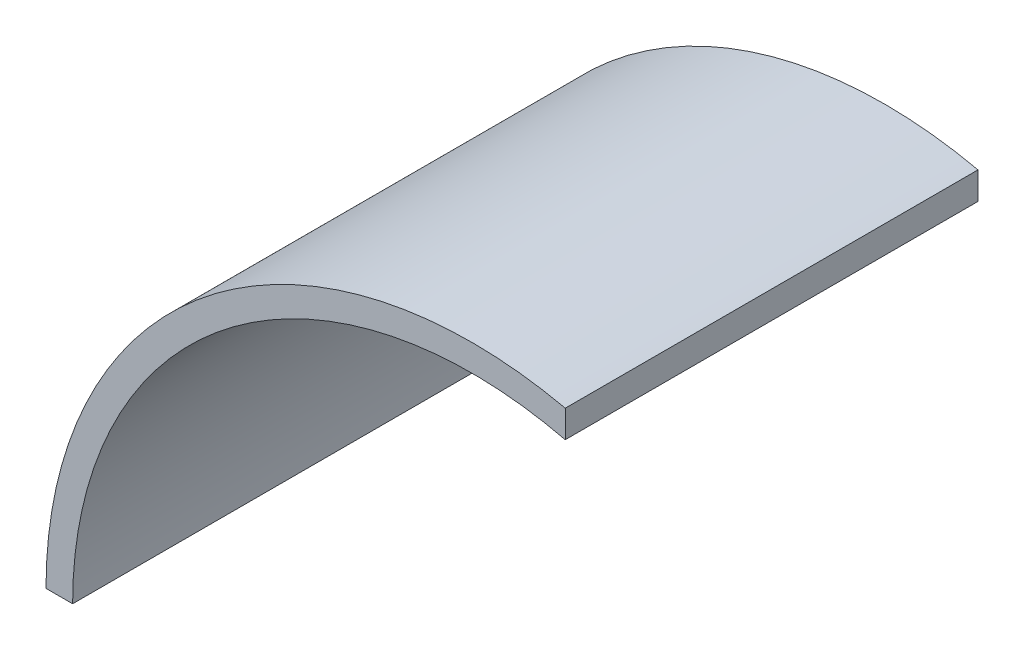
ISO-10303-21;
HEADER;
FILE_DESCRIPTION(('STEP AP214'),'2;1');
FILE_NAME('part.step','',(''),(''),'','','');
FILE_SCHEMA(('AUTOMOTIVE_DESIGN { 1 0 10303 214 1 1 1 1 }'));
ENDSEC;
DATA;
#1=APPLICATION_CONTEXT('core data for automotive mechanical design processes');
#2=APPLICATION_PROTOCOL_DEFINITION('international standard','automotive_design',2000,#1);
#3=PRODUCT_CONTEXT('',#1,'mechanical');
#4=PRODUCT('Part','Part','',(#3));
#5=PRODUCT_RELATED_PRODUCT_CATEGORY('part','',(#4));
#6=PRODUCT_DEFINITION_FORMATION('','',#4);
#7=PRODUCT_DEFINITION_CONTEXT('part definition',#1,'design');
#8=PRODUCT_DEFINITION('design','',#6,#7);
#9=PRODUCT_DEFINITION_SHAPE('','',#8);
#10=(LENGTH_UNIT() NAMED_UNIT(*) SI_UNIT(.MILLI.,.METRE.));
#11=(NAMED_UNIT(*) PLANE_ANGLE_UNIT() SI_UNIT($,.RADIAN.));
#12=(NAMED_UNIT(*) SI_UNIT($,.STERADIAN.) SOLID_ANGLE_UNIT());
#13=UNCERTAINTY_MEASURE_WITH_UNIT(LENGTH_MEASURE(1.E-05),#10,'distance_accuracy_value','');
#14=(GEOMETRIC_REPRESENTATION_CONTEXT(3) GLOBAL_UNCERTAINTY_ASSIGNED_CONTEXT((#13)) GLOBAL_UNIT_ASSIGNED_CONTEXT((#10,
#11,#12)) REPRESENTATION_CONTEXT('',''));
#15=CARTESIAN_POINT('',(0.,0.,0.));
#16=DIRECTION('',(0.,0.,1.));
#17=DIRECTION('',(1.,0.,0.));
#18=AXIS2_PLACEMENT_3D('',#15,#16,#17);
#19=CARTESIAN_POINT('',(0.,0.,155.));
#20=DIRECTION('',(0.,0.,-1.));
#21=DIRECTION('',(-1.,0.,0.));
#22=AXIS2_PLACEMENT_3D('',#19,#20,#21);
#23=CYLINDRICAL_SURFACE('',#22,160.);
#24=CARTESIAN_POINT('',(0.,0.,0.));
#25=DIRECTION('',(0.,0.,1.));
#26=DIRECTION('',(-1.,0.,0.));
#27=AXIS2_PLACEMENT_3D('',#24,#25,#26);
#28=CIRCLE('',#27,160.);
#29=CARTESIAN_POINT('',(35.,156.12494995996,0.));
#30=VERTEX_POINT('',#29);
#31=CARTESIAN_POINT('',(-160.,0.,0.));
#32=VERTEX_POINT('',#31);
#33=EDGE_CURVE('E97',#30,#32,#28,.T.);
#34=ORIENTED_EDGE('',*,*,#33,.T.);
#35=DIRECTION('',(0.,0.,-1.));
#36=VECTOR('',#35,1.);
#37=CARTESIAN_POINT('',(-160.,0.,155.));
#38=LINE('',#37,#36);
#39=CARTESIAN_POINT('',(-160.,0.,155.));
#40=VERTEX_POINT('',#39);
#41=EDGE_CURVE('E11',#40,#32,#38,.T.);
#42=ORIENTED_EDGE('',*,*,#41,.F.);
#43=CARTESIAN_POINT('',(0.,0.,155.));
#44=DIRECTION('',(0.,0.,1.));
#45=DIRECTION('',(-1.,0.,0.));
#46=AXIS2_PLACEMENT_3D('',#43,#44,#45);
#47=CIRCLE('',#46,160.);
#48=CARTESIAN_POINT('',(35.,156.12494995996,155.));
#49=VERTEX_POINT('',#48);
#50=EDGE_CURVE('E85',#49,#40,#47,.T.);
#51=ORIENTED_EDGE('',*,*,#50,.F.);
#52=DIRECTION('',(0.,0.,-1.));
#53=VECTOR('',#52,1.);
#54=CARTESIAN_POINT('',(35.,156.12494995996,155.));
#55=LINE('',#54,#53);
#56=EDGE_CURVE('E93',#49,#30,#55,.T.);
#57=ORIENTED_EDGE('',*,*,#56,.T.);
#58=EDGE_LOOP('',(#34,#42,#51,#57));
#59=FACE_BOUND('',#58,.T.);
#60=ADVANCED_FACE('F34',(#59),#23,.T.);
#61=CARTESIAN_POINT('',(-160.,0.,155.));
#62=DIRECTION('',(0.,1.,0.));
#63=DIRECTION('',(-1.,0.,0.));
#64=AXIS2_PLACEMENT_3D('',#61,#62,#63);
#65=PLANE('',#64);
#66=DIRECTION('',(1.,0.,0.));
#67=VECTOR('',#66,1.);
#68=CARTESIAN_POINT('',(-160.,0.,0.));
#69=LINE('',#68,#67);
#70=CARTESIAN_POINT('',(-150.,0.,0.));
#71=VERTEX_POINT('',#70);
#72=EDGE_CURVE('E89',#32,#71,#69,.T.);
#73=ORIENTED_EDGE('',*,*,#72,.T.);
#74=DIRECTION('',(0.,0.,-1.));
#75=VECTOR('',#74,1.);
#76=CARTESIAN_POINT('',(-150.,0.,155.));
#77=LINE('',#76,#75);
#78=CARTESIAN_POINT('',(-150.,0.,155.));
#79=VERTEX_POINT('',#78);
#80=EDGE_CURVE('E42',#79,#71,#77,.T.);
#81=ORIENTED_EDGE('',*,*,#80,.F.);
#82=DIRECTION('',(1.,0.,0.));
#83=VECTOR('',#82,1.);
#84=CARTESIAN_POINT('',(-160.,0.,155.));
#85=LINE('',#84,#83);
#86=EDGE_CURVE('E80',#40,#79,#85,.T.);
#87=ORIENTED_EDGE('',*,*,#86,.F.);
#88=ORIENTED_EDGE('',*,*,#41,.T.);
#89=EDGE_LOOP('',(#73,#81,#87,#88));
#90=FACE_BOUND('',#89,.T.);
#91=ADVANCED_FACE('F88',(#90),#65,.F.);
#92=CARTESIAN_POINT('',(0.,0.,155.));
#93=DIRECTION('',(0.,0.,-1.));
#94=DIRECTION('',(-1.,0.,0.));
#95=AXIS2_PLACEMENT_3D('',#92,#93,#94);
#96=CYLINDRICAL_SURFACE('',#95,150.);
#97=CARTESIAN_POINT('',(0.,0.,0.));
#98=DIRECTION('',(0.,0.,-1.));
#99=DIRECTION('',(-1.,0.,0.));
#100=AXIS2_PLACEMENT_3D('',#97,#98,#99);
#101=CIRCLE('',#100,150.);
#102=CARTESIAN_POINT('',(35.,145.859521458148,0.));
#103=VERTEX_POINT('',#102);
#104=EDGE_CURVE('E67',#71,#103,#101,.T.);
#105=ORIENTED_EDGE('',*,*,#104,.T.);
#106=DIRECTION('',(0.,0.,-1.));
#107=VECTOR('',#106,1.);
#108=CARTESIAN_POINT('',(35.,145.859521458148,155.));
#109=LINE('',#108,#107);
#110=CARTESIAN_POINT('',(35.,145.859521458148,155.));
#111=VERTEX_POINT('',#110);
#112=EDGE_CURVE('E90',#111,#103,#109,.T.);
#113=ORIENTED_EDGE('',*,*,#112,.F.);
#114=CARTESIAN_POINT('',(0.,0.,155.));
#115=DIRECTION('',(0.,0.,-1.));
#116=DIRECTION('',(-1.,0.,0.));
#117=AXIS2_PLACEMENT_3D('',#114,#115,#116);
#118=CIRCLE('',#117,150.);
#119=EDGE_CURVE('E83',#79,#111,#118,.T.);
#120=ORIENTED_EDGE('',*,*,#119,.F.);
#121=ORIENTED_EDGE('',*,*,#80,.T.);
#122=EDGE_LOOP('',(#105,#113,#120,#121));
#123=FACE_BOUND('',#122,.T.);
#124=ADVANCED_FACE('F91',(#123),#96,.F.);
#125=CARTESIAN_POINT('',(35.,156.12494995996,155.));
#126=DIRECTION('',(-1.,0.,0.));
#127=DIRECTION('',(0.,0.,1.));
#128=AXIS2_PLACEMENT_3D('',#125,#126,#127);
#129=PLANE('',#128);
#130=DIRECTION('',(0.,1.,0.));
#131=VECTOR('',#130,1.);
#132=CARTESIAN_POINT('',(35.,156.12494995996,0.));
#133=LINE('',#132,#131);
#134=EDGE_CURVE('E73',#103,#30,#133,.T.);
#135=ORIENTED_EDGE('',*,*,#134,.T.);
#136=ORIENTED_EDGE('',*,*,#56,.F.);
#137=DIRECTION('',(0.,1.,0.));
#138=VECTOR('',#137,1.);
#139=CARTESIAN_POINT('',(35.,156.12494995996,155.));
#140=LINE('',#139,#138);
#141=EDGE_CURVE('E50',#111,#49,#140,.T.);
#142=ORIENTED_EDGE('',*,*,#141,.F.);
#143=ORIENTED_EDGE('',*,*,#112,.T.);
#144=EDGE_LOOP('',(#135,#136,#142,#143));
#145=FACE_BOUND('',#144,.T.);
#146=ADVANCED_FACE('F104',(#145),#129,.F.);
#147=CARTESIAN_POINT('',(0.,0.,155.));
#148=DIRECTION('',(0.,0.,-1.));
#149=DIRECTION('',(-1.,0.,0.));
#150=AXIS2_PLACEMENT_3D('',#147,#148,#149);
#151=PLANE('',#150);
#152=ORIENTED_EDGE('',*,*,#50,.T.);
#153=ORIENTED_EDGE('',*,*,#86,.T.);
#154=ORIENTED_EDGE('',*,*,#119,.T.);
#155=ORIENTED_EDGE('',*,*,#141,.T.);
#156=EDGE_LOOP('',(#152,#153,#154,#155));
#157=FACE_BOUND('',#156,.T.);
#158=ADVANCED_FACE('F81',(#157),#151,.F.);
#159=CARTESIAN_POINT('',(0.,0.,0.));
#160=DIRECTION('',(0.,0.,-1.));
#161=DIRECTION('',(-1.,0.,0.));
#162=AXIS2_PLACEMENT_3D('',#159,#160,#161);
#163=PLANE('',#162);
#164=ORIENTED_EDGE('',*,*,#33,.F.);
#165=ORIENTED_EDGE('',*,*,#134,.F.);
#166=ORIENTED_EDGE('',*,*,#104,.F.);
#167=ORIENTED_EDGE('',*,*,#72,.F.);
#168=EDGE_LOOP('',(#164,#165,#166,#167));
#169=FACE_BOUND('',#168,.T.);
#170=ADVANCED_FACE('F107',(#169),#163,.T.);
#171=CLOSED_SHELL('',(#60,#91,#124,#146,#158,#170));
#172=MANIFOLD_SOLID_BREP('B2',#171);
#173=ADVANCED_BREP_SHAPE_REPRESENTATION('',(#18,#172),#14);
#174=SHAPE_DEFINITION_REPRESENTATION(#9,#173);
ENDSEC;
END-ISO-10303-21;
